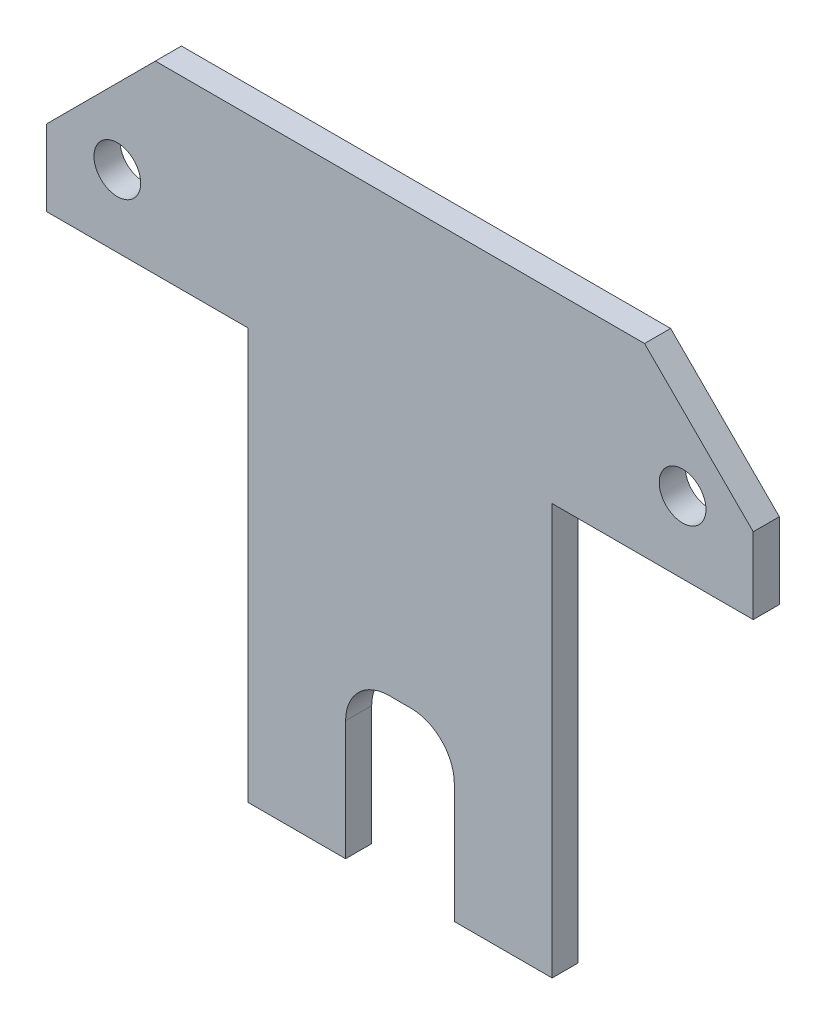
ISO-10303-21;
HEADER;
FILE_DESCRIPTION(('STEP AP214'),'2;1');
FILE_NAME('part.step','',(''),(''),'','','');
FILE_SCHEMA(('AUTOMOTIVE_DESIGN { 1 0 10303 214 1 1 1 1 }'));
ENDSEC;
DATA;
#1=APPLICATION_CONTEXT('core data for automotive mechanical design processes');
#2=APPLICATION_PROTOCOL_DEFINITION('international standard','automotive_design',2000,#1);
#3=PRODUCT_CONTEXT('',#1,'mechanical');
#4=PRODUCT('Part','Part','',(#3));
#5=PRODUCT_RELATED_PRODUCT_CATEGORY('part','',(#4));
#6=PRODUCT_DEFINITION_FORMATION('','',#4);
#7=PRODUCT_DEFINITION_CONTEXT('part definition',#1,'design');
#8=PRODUCT_DEFINITION('design','',#6,#7);
#9=PRODUCT_DEFINITION_SHAPE('','',#8);
#10=(LENGTH_UNIT() NAMED_UNIT(*) SI_UNIT(.MILLI.,.METRE.));
#11=(NAMED_UNIT(*) PLANE_ANGLE_UNIT() SI_UNIT($,.RADIAN.));
#12=(NAMED_UNIT(*) SI_UNIT($,.STERADIAN.) SOLID_ANGLE_UNIT());
#13=UNCERTAINTY_MEASURE_WITH_UNIT(LENGTH_MEASURE(1.E-05),#10,'distance_accuracy_value','');
#14=(GEOMETRIC_REPRESENTATION_CONTEXT(3) GLOBAL_UNCERTAINTY_ASSIGNED_CONTEXT((#13)) GLOBAL_UNIT_ASSIGNED_CONTEXT((#10,
#11,#12)) REPRESENTATION_CONTEXT('',''));
#15=CARTESIAN_POINT('',(0.,0.,0.));
#16=DIRECTION('',(0.,0.,1.));
#17=DIRECTION('',(1.,0.,0.));
#18=AXIS2_PLACEMENT_3D('',#15,#16,#17);
#19=CARTESIAN_POINT('',(15.3944155171797,-21.7253473807906,2.4));
#20=DIRECTION('',(0.,1.,0.));
#21=DIRECTION('',(0.,0.,1.));
#22=AXIS2_PLACEMENT_3D('',#19,#20,#21);
#23=PLANE('',#22);
#24=DIRECTION('',(1.,0.,0.));
#25=VECTOR('',#24,1.);
#26=CARTESIAN_POINT('',(15.3944155171797,-21.7253473807906,0.));
#27=LINE('',#26,#25);
#28=CARTESIAN_POINT('',(-12.6055844828203,-21.7253473807906,0.));
#29=VERTEX_POINT('',#28);
#30=CARTESIAN_POINT('',(-3.60558448282027,-21.7253473807906,0.));
#31=VERTEX_POINT('',#30);
#32=EDGE_CURVE('E165',#29,#31,#27,.T.);
#33=ORIENTED_EDGE('',*,*,#32,.T.);
#34=DIRECTION('',(0.,0.,1.));
#35=VECTOR('',#34,1.);
#36=CARTESIAN_POINT('',(-3.60558448282027,-21.7253473807906,2.4));
#37=LINE('',#36,#35);
#38=CARTESIAN_POINT('',(-3.60558448282027,-21.7253473807906,2.4));
#39=VERTEX_POINT('',#38);
#40=EDGE_CURVE('E153',#31,#39,#37,.T.);
#41=ORIENTED_EDGE('',*,*,#40,.T.);
#42=DIRECTION('',(1.,0.,0.));
#43=VECTOR('',#42,1.);
#44=CARTESIAN_POINT('',(15.3944155171797,-21.7253473807906,2.4));
#45=LINE('',#44,#43);
#46=CARTESIAN_POINT('',(-12.6055844828203,-21.7253473807906,2.4));
#47=VERTEX_POINT('',#46);
#48=EDGE_CURVE('E163',#47,#39,#45,.T.);
#49=ORIENTED_EDGE('',*,*,#48,.F.);
#50=DIRECTION('',(0.,0.,-1.));
#51=VECTOR('',#50,1.);
#52=CARTESIAN_POINT('',(-12.6055844828203,-21.7253473807906,2.4));
#53=LINE('',#52,#51);
#54=EDGE_CURVE('E230',#47,#29,#53,.T.);
#55=ORIENTED_EDGE('',*,*,#54,.T.);
#56=EDGE_LOOP('',(#33,#41,#49,#55));
#57=FACE_BOUND('',#56,.T.);
#58=ADVANCED_FACE('F38',(#57),#23,.F.);
#59=CARTESIAN_POINT('',(0.,0.,2.4));
#60=DIRECTION('',(0.,0.,-1.));
#61=DIRECTION('',(-1.,0.,0.));
#62=AXIS2_PLACEMENT_3D('',#59,#60,#61);
#63=PLANE('',#62);
#64=ORIENTED_EDGE('',*,*,#48,.T.);
#65=DIRECTION('',(0.,-1.,0.));
#66=VECTOR('',#65,1.);
#67=CARTESIAN_POINT('',(-3.60558448282027,-36.7253473807905,2.4));
#68=LINE('',#67,#66);
#69=CARTESIAN_POINT('',(-3.60558448282027,-10.7253473807906,2.4));
#70=VERTEX_POINT('',#69);
#71=EDGE_CURVE('E150',#70,#39,#68,.T.);
#72=ORIENTED_EDGE('',*,*,#71,.F.);
#73=CARTESIAN_POINT('',(0.394415517179731,-10.7253473807906,2.4));
#74=DIRECTION('',(0.,0.,-1.));
#75=DIRECTION('',(-1.,0.,0.));
#76=AXIS2_PLACEMENT_3D('',#73,#74,#75);
#77=CIRCLE('',#76,4.);
#78=CARTESIAN_POINT('',(0.394415517179728,-6.72534738079056,2.4));
#79=VERTEX_POINT('',#78);
#80=EDGE_CURVE('E46',#70,#79,#77,.T.);
#81=ORIENTED_EDGE('',*,*,#80,.T.);
#82=DIRECTION('',(-1.,0.,0.));
#83=VECTOR('',#82,1.);
#84=CARTESIAN_POINT('',(6.39441551717973,-6.72534738079055,2.4));
#85=LINE('',#84,#83);
#86=CARTESIAN_POINT('',(2.39441551717973,-6.72534738079056,2.4));
#87=VERTEX_POINT('',#86);
#88=EDGE_CURVE('E255',#87,#79,#85,.T.);
#89=ORIENTED_EDGE('',*,*,#88,.F.);
#90=CARTESIAN_POINT('',(2.39441551717973,-10.7253473807906,2.4));
#91=DIRECTION('',(0.,0.,-1.));
#92=DIRECTION('',(-1.,0.,0.));
#93=AXIS2_PLACEMENT_3D('',#90,#91,#92);
#94=CIRCLE('',#93,4.);
#95=CARTESIAN_POINT('',(6.39441551717973,-10.7253473807906,2.4));
#96=VERTEX_POINT('',#95);
#97=EDGE_CURVE('E250',#87,#96,#94,.T.);
#98=ORIENTED_EDGE('',*,*,#97,.T.);
#99=DIRECTION('',(0.,1.,0.));
#100=VECTOR('',#99,1.);
#101=CARTESIAN_POINT('',(6.39441551717973,-36.7253473807906,2.4));
#102=LINE('',#101,#100);
#103=CARTESIAN_POINT('',(6.39441551717973,-21.7253473807906,2.4));
#104=VERTEX_POINT('',#103);
#105=EDGE_CURVE('E158',#104,#96,#102,.T.);
#106=ORIENTED_EDGE('',*,*,#105,.F.);
#107=CARTESIAN_POINT('',(15.3944155171797,-21.7253473807906,2.4));
#108=VERTEX_POINT('',#107);
#109=EDGE_CURVE('E175',#104,#108,#45,.T.);
#110=ORIENTED_EDGE('',*,*,#109,.T.);
#111=DIRECTION('',(0.,1.,0.));
#112=VECTOR('',#111,1.);
#113=CARTESIAN_POINT('',(15.3944155171797,16.0746526192094,2.4));
#114=LINE('',#113,#112);
#115=CARTESIAN_POINT('',(15.3944155171797,16.0746526192094,2.4));
#116=VERTEX_POINT('',#115);
#117=EDGE_CURVE('E174',#108,#116,#114,.T.);
#118=ORIENTED_EDGE('',*,*,#117,.T.);
#119=DIRECTION('',(1.,0.,0.));
#120=VECTOR('',#119,1.);
#121=CARTESIAN_POINT('',(33.8944155171797,16.0746526192094,2.4));
#122=LINE('',#121,#120);
#123=CARTESIAN_POINT('',(33.8944155171797,16.0746526192094,2.4));
#124=VERTEX_POINT('',#123);
#125=EDGE_CURVE('E177',#116,#124,#122,.T.);
#126=ORIENTED_EDGE('',*,*,#125,.T.);
#127=DIRECTION('',(0.,1.,0.));
#128=VECTOR('',#127,1.);
#129=CARTESIAN_POINT('',(33.8944155171797,23.0746526192094,2.4));
#130=LINE('',#129,#128);
#131=CARTESIAN_POINT('',(33.8944155171797,23.0746526192094,2.4));
#132=VERTEX_POINT('',#131);
#133=EDGE_CURVE('E183',#124,#132,#130,.T.);
#134=ORIENTED_EDGE('',*,*,#133,.T.);
#135=DIRECTION('',(-0.707106781186548,0.707106781186547,0.));
#136=VECTOR('',#135,1.);
#137=CARTESIAN_POINT('',(23.8944155171797,33.0746526192094,2.4));
#138=LINE('',#137,#136);
#139=CARTESIAN_POINT('',(23.8944155171797,33.0746526192094,2.4));
#140=VERTEX_POINT('',#139);
#141=EDGE_CURVE('E185',#132,#140,#138,.T.);
#142=ORIENTED_EDGE('',*,*,#141,.T.);
#143=DIRECTION('',(-1.,0.,0.));
#144=VECTOR('',#143,1.);
#145=CARTESIAN_POINT('',(-21.1055844828203,33.0746526192094,2.4));
#146=LINE('',#145,#144);
#147=CARTESIAN_POINT('',(-21.1055844828203,33.0746526192094,2.4));
#148=VERTEX_POINT('',#147);
#149=EDGE_CURVE('E187',#140,#148,#146,.T.);
#150=ORIENTED_EDGE('',*,*,#149,.T.);
#151=DIRECTION('',(-0.707106781186548,-0.707106781186547,0.));
#152=VECTOR('',#151,1.);
#153=CARTESIAN_POINT('',(-31.1055844828203,23.0746526192094,2.4));
#154=LINE('',#153,#152);
#155=CARTESIAN_POINT('',(-31.1055844828203,23.0746526192094,2.4));
#156=VERTEX_POINT('',#155);
#157=EDGE_CURVE('E212',#148,#156,#154,.T.);
#158=ORIENTED_EDGE('',*,*,#157,.T.);
#159=DIRECTION('',(0.,-1.,0.));
#160=VECTOR('',#159,1.);
#161=CARTESIAN_POINT('',(-31.1055844828203,16.0746526192094,2.4));
#162=LINE('',#161,#160);
#163=CARTESIAN_POINT('',(-31.1055844828203,16.0746526192094,2.4));
#164=VERTEX_POINT('',#163);
#165=EDGE_CURVE('E316',#156,#164,#162,.T.);
#166=ORIENTED_EDGE('',*,*,#165,.T.);
#167=DIRECTION('',(1.,0.,0.));
#168=VECTOR('',#167,1.);
#169=CARTESIAN_POINT('',(-12.6055844828203,16.0746526192094,2.4));
#170=LINE('',#169,#168);
#171=CARTESIAN_POINT('',(-12.6055844828203,16.0746526192094,2.4));
#172=VERTEX_POINT('',#171);
#173=EDGE_CURVE('E317',#164,#172,#170,.T.);
#174=ORIENTED_EDGE('',*,*,#173,.T.);
#175=DIRECTION('',(0.,-1.,0.));
#176=VECTOR('',#175,1.);
#177=CARTESIAN_POINT('',(-12.6055844828203,-21.7253473807906,2.4));
#178=LINE('',#177,#176);
#179=EDGE_CURVE('E172',#172,#47,#178,.T.);
#180=ORIENTED_EDGE('',*,*,#179,.T.);
#181=EDGE_LOOP('',(#64,#72,#81,#89,#98,#106,#110,#118,#126,#134,#142,#150,#158,#166,#174,#180));
#182=FACE_BOUND('',#181,.T.);
#183=CARTESIAN_POINT('',(-24.6055844828203,22.6746526192094,2.4));
#184=DIRECTION('',(0.,0.,1.));
#185=DIRECTION('',(1.,0.,0.));
#186=AXIS2_PLACEMENT_3D('',#183,#184,#185);
#187=CIRCLE('',#186,2.15);
#188=CARTESIAN_POINT('',(-22.4555844828203,22.6746526192094,2.4));
#189=VERTEX_POINT('',#188);
#190=EDGE_CURVE('E194',#189,#189,#187,.T.);
#191=ORIENTED_EDGE('',*,*,#190,.F.);
#192=EDGE_LOOP('',(#191));
#193=FACE_BOUND('',#192,.T.);
#194=CARTESIAN_POINT('',(27.3944155171797,22.6746526192094,2.4));
#195=DIRECTION('',(0.,0.,1.));
#196=DIRECTION('',(1.,0.,0.));
#197=AXIS2_PLACEMENT_3D('',#194,#195,#196);
#198=CIRCLE('',#197,2.15);
#199=CARTESIAN_POINT('',(29.5444155171797,22.6746526192094,2.4));
#200=VERTEX_POINT('',#199);
#201=EDGE_CURVE('E302',#200,#200,#198,.T.);
#202=ORIENTED_EDGE('',*,*,#201,.F.);
#203=EDGE_LOOP('',(#202));
#204=FACE_BOUND('',#203,.T.);
#205=ADVANCED_FACE('F169',(#182,#193,#204),#63,.F.);
#206=CARTESIAN_POINT('',(0.,0.,0.));
#207=DIRECTION('',(0.,0.,-1.));
#208=DIRECTION('',(-1.,0.,0.));
#209=AXIS2_PLACEMENT_3D('',#206,#207,#208);
#210=PLANE('',#209);
#211=DIRECTION('',(-1.,0.,0.));
#212=VECTOR('',#211,1.);
#213=CARTESIAN_POINT('',(6.39441551717973,-6.72534738079055,0.));
#214=LINE('',#213,#212);
#215=CARTESIAN_POINT('',(2.39441551717973,-6.72534738079056,0.));
#216=VERTEX_POINT('',#215);
#217=CARTESIAN_POINT('',(0.394415517179728,-6.72534738079056,0.));
#218=VERTEX_POINT('',#217);
#219=EDGE_CURVE('E309',#216,#218,#214,.T.);
#220=ORIENTED_EDGE('',*,*,#219,.T.);
#221=CARTESIAN_POINT('',(0.394415517179731,-10.7253473807906,0.));
#222=DIRECTION('',(0.,0.,-1.));
#223=DIRECTION('',(-1.,0.,0.));
#224=AXIS2_PLACEMENT_3D('',#221,#222,#223);
#225=CIRCLE('',#224,4.);
#226=CARTESIAN_POINT('',(-3.60558448282027,-10.7253473807906,0.));
#227=VERTEX_POINT('',#226);
#228=EDGE_CURVE('E11',#218,#227,#225,.F.);
#229=ORIENTED_EDGE('',*,*,#228,.T.);
#230=DIRECTION('',(0.,-1.,0.));
#231=VECTOR('',#230,1.);
#232=CARTESIAN_POINT('',(-3.60558448282027,-36.7253473807905,0.));
#233=LINE('',#232,#231);
#234=EDGE_CURVE('E260',#227,#31,#233,.T.);
#235=ORIENTED_EDGE('',*,*,#234,.T.);
#236=ORIENTED_EDGE('',*,*,#32,.F.);
#237=DIRECTION('',(0.,-1.,0.));
#238=VECTOR('',#237,1.);
#239=CARTESIAN_POINT('',(-12.6055844828203,-21.7253473807906,0.));
#240=LINE('',#239,#238);
#241=CARTESIAN_POINT('',(-12.6055844828203,16.0746526192094,0.));
#242=VERTEX_POINT('',#241);
#243=EDGE_CURVE('E198',#242,#29,#240,.T.);
#244=ORIENTED_EDGE('',*,*,#243,.F.);
#245=DIRECTION('',(1.,0.,0.));
#246=VECTOR('',#245,1.);
#247=CARTESIAN_POINT('',(-12.6055844828203,16.0746526192094,0.));
#248=LINE('',#247,#246);
#249=CARTESIAN_POINT('',(-31.1055844828203,16.0746526192094,0.));
#250=VERTEX_POINT('',#249);
#251=EDGE_CURVE('E196',#250,#242,#248,.T.);
#252=ORIENTED_EDGE('',*,*,#251,.F.);
#253=DIRECTION('',(0.,-1.,0.));
#254=VECTOR('',#253,1.);
#255=CARTESIAN_POINT('',(-31.1055844828203,16.0746526192094,0.));
#256=LINE('',#255,#254);
#257=CARTESIAN_POINT('',(-31.1055844828203,23.0746526192094,0.));
#258=VERTEX_POINT('',#257);
#259=EDGE_CURVE('E193',#258,#250,#256,.T.);
#260=ORIENTED_EDGE('',*,*,#259,.F.);
#261=DIRECTION('',(-0.707106781186548,-0.707106781186547,0.));
#262=VECTOR('',#261,1.);
#263=CARTESIAN_POINT('',(-31.1055844828203,23.0746526192094,0.));
#264=LINE('',#263,#262);
#265=CARTESIAN_POINT('',(-21.1055844828203,33.0746526192094,0.));
#266=VERTEX_POINT('',#265);
#267=EDGE_CURVE('E190',#266,#258,#264,.T.);
#268=ORIENTED_EDGE('',*,*,#267,.F.);
#269=DIRECTION('',(-1.,0.,0.));
#270=VECTOR('',#269,1.);
#271=CARTESIAN_POINT('',(-21.1055844828203,33.0746526192094,0.));
#272=LINE('',#271,#270);
#273=CARTESIAN_POINT('',(23.8944155171797,33.0746526192094,0.));
#274=VERTEX_POINT('',#273);
#275=EDGE_CURVE('E210',#274,#266,#272,.T.);
#276=ORIENTED_EDGE('',*,*,#275,.F.);
#277=DIRECTION('',(-0.707106781186548,0.707106781186547,0.));
#278=VECTOR('',#277,1.);
#279=CARTESIAN_POINT('',(23.8944155171797,33.0746526192094,0.));
#280=LINE('',#279,#278);
#281=CARTESIAN_POINT('',(33.8944155171797,23.0746526192094,0.));
#282=VERTEX_POINT('',#281);
#283=EDGE_CURVE('E208',#282,#274,#280,.T.);
#284=ORIENTED_EDGE('',*,*,#283,.F.);
#285=DIRECTION('',(0.,1.,0.));
#286=VECTOR('',#285,1.);
#287=CARTESIAN_POINT('',(33.8944155171797,23.0746526192094,0.));
#288=LINE('',#287,#286);
#289=CARTESIAN_POINT('',(33.8944155171797,16.0746526192094,0.));
#290=VERTEX_POINT('',#289);
#291=EDGE_CURVE('E206',#290,#282,#288,.T.);
#292=ORIENTED_EDGE('',*,*,#291,.F.);
#293=DIRECTION('',(1.,0.,0.));
#294=VECTOR('',#293,1.);
#295=CARTESIAN_POINT('',(33.8944155171797,16.0746526192094,0.));
#296=LINE('',#295,#294);
#297=CARTESIAN_POINT('',(15.3944155171797,16.0746526192094,0.));
#298=VERTEX_POINT('',#297);
#299=EDGE_CURVE('E204',#298,#290,#296,.T.);
#300=ORIENTED_EDGE('',*,*,#299,.F.);
#301=DIRECTION('',(0.,1.,0.));
#302=VECTOR('',#301,1.);
#303=CARTESIAN_POINT('',(15.3944155171797,16.0746526192094,0.));
#304=LINE('',#303,#302);
#305=CARTESIAN_POINT('',(15.3944155171797,-21.7253473807906,0.));
#306=VERTEX_POINT('',#305);
#307=EDGE_CURVE('E202',#306,#298,#304,.T.);
#308=ORIENTED_EDGE('',*,*,#307,.F.);
#309=CARTESIAN_POINT('',(6.39441551717973,-21.7253473807906,0.));
#310=VERTEX_POINT('',#309);
#311=EDGE_CURVE('E200',#310,#306,#27,.T.);
#312=ORIENTED_EDGE('',*,*,#311,.F.);
#313=DIRECTION('',(0.,1.,0.));
#314=VECTOR('',#313,1.);
#315=CARTESIAN_POINT('',(6.39441551717973,-36.7253473807906,0.));
#316=LINE('',#315,#314);
#317=CARTESIAN_POINT('',(6.39441551717973,-10.7253473807906,0.));
#318=VERTEX_POINT('',#317);
#319=EDGE_CURVE('E325',#310,#318,#316,.T.);
#320=ORIENTED_EDGE('',*,*,#319,.T.);
#321=CARTESIAN_POINT('',(2.39441551717973,-10.7253473807906,0.));
#322=DIRECTION('',(0.,0.,-1.));
#323=DIRECTION('',(-1.,0.,0.));
#324=AXIS2_PLACEMENT_3D('',#321,#322,#323);
#325=CIRCLE('',#324,4.);
#326=EDGE_CURVE('E252',#318,#216,#325,.F.);
#327=ORIENTED_EDGE('',*,*,#326,.T.);
#328=EDGE_LOOP('',(#220,#229,#235,#236,#244,#252,#260,#268,#276,#284,#292,#300,#308,#312,#320,#327));
#329=FACE_BOUND('',#328,.T.);
#330=CARTESIAN_POINT('',(-24.6055844828203,22.6746526192094,0.));
#331=DIRECTION('',(0.,0.,1.));
#332=DIRECTION('',(1.,0.,0.));
#333=AXIS2_PLACEMENT_3D('',#330,#331,#332);
#334=CIRCLE('',#333,2.15);
#335=CARTESIAN_POINT('',(-22.4555844828203,22.6746526192094,0.));
#336=VERTEX_POINT('',#335);
#337=EDGE_CURVE('E305',#336,#336,#334,.T.);
#338=ORIENTED_EDGE('',*,*,#337,.T.);
#339=EDGE_LOOP('',(#338));
#340=FACE_BOUND('',#339,.T.);
#341=CARTESIAN_POINT('',(27.3944155171797,22.6746526192094,0.));
#342=DIRECTION('',(0.,0.,1.));
#343=DIRECTION('',(1.,0.,0.));
#344=AXIS2_PLACEMENT_3D('',#341,#342,#343);
#345=CIRCLE('',#344,2.15);
#346=CARTESIAN_POINT('',(29.5444155171797,22.6746526192094,0.));
#347=VERTEX_POINT('',#346);
#348=EDGE_CURVE('E306',#347,#347,#345,.T.);
#349=ORIENTED_EDGE('',*,*,#348,.T.);
#350=EDGE_LOOP('',(#349));
#351=FACE_BOUND('',#350,.T.);
#352=ADVANCED_FACE('F274',(#329,#340,#351),#210,.T.);
#353=CARTESIAN_POINT('',(-31.1055844828203,23.0746526192094,2.4));
#354=DIRECTION('',(0.707106781186547,-0.707106781186548,0.));
#355=DIRECTION('',(0.707106781186548,0.707106781186547,0.));
#356=AXIS2_PLACEMENT_3D('',#353,#354,#355);
#357=PLANE('',#356);
#358=ORIENTED_EDGE('',*,*,#267,.T.);
#359=DIRECTION('',(0.,0.,-1.));
#360=VECTOR('',#359,1.);
#361=CARTESIAN_POINT('',(-31.1055844828203,23.0746526192094,2.4));
#362=LINE('',#361,#360);
#363=EDGE_CURVE('E238',#156,#258,#362,.T.);
#364=ORIENTED_EDGE('',*,*,#363,.F.);
#365=ORIENTED_EDGE('',*,*,#157,.F.);
#366=DIRECTION('',(0.,0.,-1.));
#367=VECTOR('',#366,1.);
#368=CARTESIAN_POINT('',(-21.1055844828203,33.0746526192094,2.4));
#369=LINE('',#368,#367);
#370=EDGE_CURVE('E189',#148,#266,#369,.T.);
#371=ORIENTED_EDGE('',*,*,#370,.T.);
#372=EDGE_LOOP('',(#358,#364,#365,#371));
#373=FACE_BOUND('',#372,.T.);
#374=ADVANCED_FACE('F354',(#373),#357,.F.);
#375=CARTESIAN_POINT('',(-31.1055844828203,16.0746526192094,2.4));
#376=DIRECTION('',(1.,0.,0.));
#377=DIRECTION('',(0.,0.,-1.));
#378=AXIS2_PLACEMENT_3D('',#375,#376,#377);
#379=PLANE('',#378);
#380=ORIENTED_EDGE('',*,*,#259,.T.);
#381=DIRECTION('',(0.,0.,-1.));
#382=VECTOR('',#381,1.);
#383=CARTESIAN_POINT('',(-31.1055844828203,16.0746526192094,2.4));
#384=LINE('',#383,#382);
#385=EDGE_CURVE('E235',#164,#250,#384,.T.);
#386=ORIENTED_EDGE('',*,*,#385,.F.);
#387=ORIENTED_EDGE('',*,*,#165,.F.);
#388=ORIENTED_EDGE('',*,*,#363,.T.);
#389=EDGE_LOOP('',(#380,#386,#387,#388));
#390=FACE_BOUND('',#389,.T.);
#391=ADVANCED_FACE('F357',(#390),#379,.F.);
#392=CARTESIAN_POINT('',(-12.6055844828203,16.0746526192094,2.4));
#393=DIRECTION('',(0.,1.,0.));
#394=DIRECTION('',(0.,0.,1.));
#395=AXIS2_PLACEMENT_3D('',#392,#393,#394);
#396=PLANE('',#395);
#397=ORIENTED_EDGE('',*,*,#251,.T.);
#398=DIRECTION('',(0.,0.,-1.));
#399=VECTOR('',#398,1.);
#400=CARTESIAN_POINT('',(-12.6055844828203,16.0746526192094,2.4));
#401=LINE('',#400,#399);
#402=EDGE_CURVE('E232',#172,#242,#401,.T.);
#403=ORIENTED_EDGE('',*,*,#402,.F.);
#404=ORIENTED_EDGE('',*,*,#173,.F.);
#405=ORIENTED_EDGE('',*,*,#385,.T.);
#406=EDGE_LOOP('',(#397,#403,#404,#405));
#407=FACE_BOUND('',#406,.T.);
#408=ADVANCED_FACE('F288',(#407),#396,.F.);
#409=CARTESIAN_POINT('',(-12.6055844828203,-21.7253473807906,2.4));
#410=DIRECTION('',(1.,0.,0.));
#411=DIRECTION('',(0.,0.,-1.));
#412=AXIS2_PLACEMENT_3D('',#409,#410,#411);
#413=PLANE('',#412);
#414=ORIENTED_EDGE('',*,*,#243,.T.);
#415=ORIENTED_EDGE('',*,*,#54,.F.);
#416=ORIENTED_EDGE('',*,*,#179,.F.);
#417=ORIENTED_EDGE('',*,*,#402,.T.);
#418=EDGE_LOOP('',(#414,#415,#416,#417));
#419=FACE_BOUND('',#418,.T.);
#420=ADVANCED_FACE('F280',(#419),#413,.F.);
#421=ORIENTED_EDGE('',*,*,#109,.F.);
#422=DIRECTION('',(0.,0.,-1.));
#423=VECTOR('',#422,1.);
#424=CARTESIAN_POINT('',(6.39441551717973,-21.7253473807906,2.4));
#425=LINE('',#424,#423);
#426=EDGE_CURVE('E167',#104,#310,#425,.T.);
#427=ORIENTED_EDGE('',*,*,#426,.T.);
#428=ORIENTED_EDGE('',*,*,#311,.T.);
#429=DIRECTION('',(0.,0.,-1.));
#430=VECTOR('',#429,1.);
#431=CARTESIAN_POINT('',(15.3944155171797,-21.7253473807906,2.4));
#432=LINE('',#431,#430);
#433=EDGE_CURVE('E227',#108,#306,#432,.T.);
#434=ORIENTED_EDGE('',*,*,#433,.F.);
#435=EDGE_LOOP('',(#421,#427,#428,#434));
#436=FACE_BOUND('',#435,.T.);
#437=ADVANCED_FACE('F270',(#436),#23,.F.);
#438=CARTESIAN_POINT('',(15.3944155171797,16.0746526192094,2.4));
#439=DIRECTION('',(-1.,0.,0.));
#440=DIRECTION('',(0.,-1.,0.));
#441=AXIS2_PLACEMENT_3D('',#438,#439,#440);
#442=PLANE('',#441);
#443=ORIENTED_EDGE('',*,*,#307,.T.);
#444=DIRECTION('',(0.,0.,-1.));
#445=VECTOR('',#444,1.);
#446=CARTESIAN_POINT('',(15.3944155171797,16.0746526192094,2.4));
#447=LINE('',#446,#445);
#448=EDGE_CURVE('E224',#116,#298,#447,.T.);
#449=ORIENTED_EDGE('',*,*,#448,.F.);
#450=ORIENTED_EDGE('',*,*,#117,.F.);
#451=ORIENTED_EDGE('',*,*,#433,.T.);
#452=EDGE_LOOP('',(#443,#449,#450,#451));
#453=FACE_BOUND('',#452,.T.);
#454=ADVANCED_FACE('F279',(#453),#442,.F.);
#455=CARTESIAN_POINT('',(33.8944155171797,16.0746526192094,2.4));
#456=DIRECTION('',(0.,1.,0.));
#457=DIRECTION('',(0.,0.,1.));
#458=AXIS2_PLACEMENT_3D('',#455,#456,#457);
#459=PLANE('',#458);
#460=ORIENTED_EDGE('',*,*,#299,.T.);
#461=DIRECTION('',(0.,0.,-1.));
#462=VECTOR('',#461,1.);
#463=CARTESIAN_POINT('',(33.8944155171797,16.0746526192094,2.4));
#464=LINE('',#463,#462);
#465=EDGE_CURVE('E221',#124,#290,#464,.T.);
#466=ORIENTED_EDGE('',*,*,#465,.F.);
#467=ORIENTED_EDGE('',*,*,#125,.F.);
#468=ORIENTED_EDGE('',*,*,#448,.T.);
#469=EDGE_LOOP('',(#460,#466,#467,#468));
#470=FACE_BOUND('',#469,.T.);
#471=ADVANCED_FACE('F286',(#470),#459,.F.);
#472=CARTESIAN_POINT('',(33.8944155171797,23.0746526192094,2.4));
#473=DIRECTION('',(-1.,0.,0.));
#474=DIRECTION('',(0.,0.,1.));
#475=AXIS2_PLACEMENT_3D('',#472,#473,#474);
#476=PLANE('',#475);
#477=ORIENTED_EDGE('',*,*,#291,.T.);
#478=DIRECTION('',(0.,0.,-1.));
#479=VECTOR('',#478,1.);
#480=CARTESIAN_POINT('',(33.8944155171797,23.0746526192094,2.4));
#481=LINE('',#480,#479);
#482=EDGE_CURVE('E218',#132,#282,#481,.T.);
#483=ORIENTED_EDGE('',*,*,#482,.F.);
#484=ORIENTED_EDGE('',*,*,#133,.F.);
#485=ORIENTED_EDGE('',*,*,#465,.T.);
#486=EDGE_LOOP('',(#477,#483,#484,#485));
#487=FACE_BOUND('',#486,.T.);
#488=ADVANCED_FACE('F341',(#487),#476,.F.);
#489=CARTESIAN_POINT('',(23.8944155171797,33.0746526192094,2.4));
#490=DIRECTION('',(-0.707106781186547,-0.707106781186548,0.));
#491=DIRECTION('',(0.707106781186548,-0.707106781186547,0.));
#492=AXIS2_PLACEMENT_3D('',#489,#490,#491);
#493=PLANE('',#492);
#494=ORIENTED_EDGE('',*,*,#283,.T.);
#495=DIRECTION('',(0.,0.,-1.));
#496=VECTOR('',#495,1.);
#497=CARTESIAN_POINT('',(23.8944155171797,33.0746526192094,2.4));
#498=LINE('',#497,#496);
#499=EDGE_CURVE('E215',#140,#274,#498,.T.);
#500=ORIENTED_EDGE('',*,*,#499,.F.);
#501=ORIENTED_EDGE('',*,*,#141,.F.);
#502=ORIENTED_EDGE('',*,*,#482,.T.);
#503=EDGE_LOOP('',(#494,#500,#501,#502));
#504=FACE_BOUND('',#503,.T.);
#505=ADVANCED_FACE('F345',(#504),#493,.F.);
#506=CARTESIAN_POINT('',(-21.1055844828203,33.0746526192094,2.4));
#507=DIRECTION('',(0.,-1.,0.));
#508=DIRECTION('',(0.,0.,-1.));
#509=AXIS2_PLACEMENT_3D('',#506,#507,#508);
#510=PLANE('',#509);
#511=ORIENTED_EDGE('',*,*,#275,.T.);
#512=ORIENTED_EDGE('',*,*,#370,.F.);
#513=ORIENTED_EDGE('',*,*,#149,.F.);
#514=ORIENTED_EDGE('',*,*,#499,.T.);
#515=EDGE_LOOP('',(#511,#512,#513,#514));
#516=FACE_BOUND('',#515,.T.);
#517=ADVANCED_FACE('F350',(#516),#510,.F.);
#518=CARTESIAN_POINT('',(-24.6055844828203,22.6746526192094,2.4));
#519=DIRECTION('',(0.,0.,-1.));
#520=DIRECTION('',(-1.,0.,0.));
#521=AXIS2_PLACEMENT_3D('',#518,#519,#520);
#522=CYLINDRICAL_SURFACE('',#521,2.15);
#523=ORIENTED_EDGE('',*,*,#190,.T.);
#524=EDGE_LOOP('',(#523));
#525=FACE_BOUND('',#524,.T.);
#526=ORIENTED_EDGE('',*,*,#337,.F.);
#527=EDGE_LOOP('',(#526));
#528=FACE_BOUND('',#527,.T.);
#529=ADVANCED_FACE('F376',(#525,#528),#522,.F.);
#530=CARTESIAN_POINT('',(27.3944155171797,22.6746526192094,2.4));
#531=DIRECTION('',(0.,0.,-1.));
#532=DIRECTION('',(-1.,0.,0.));
#533=AXIS2_PLACEMENT_3D('',#530,#531,#532);
#534=CYLINDRICAL_SURFACE('',#533,2.15);
#535=ORIENTED_EDGE('',*,*,#201,.T.);
#536=EDGE_LOOP('',(#535));
#537=FACE_BOUND('',#536,.T.);
#538=ORIENTED_EDGE('',*,*,#348,.F.);
#539=EDGE_LOOP('',(#538));
#540=FACE_BOUND('',#539,.T.);
#541=ADVANCED_FACE('F404',(#537,#540),#534,.F.);
#542=CARTESIAN_POINT('',(-3.60558448282027,-36.7253473807905,0.));
#543=DIRECTION('',(-1.,0.,0.));
#544=DIRECTION('',(0.,-1.,0.));
#545=AXIS2_PLACEMENT_3D('',#542,#543,#544);
#546=PLANE('',#545);
#547=ORIENTED_EDGE('',*,*,#234,.F.);
#548=DIRECTION('',(0.,0.,1.));
#549=VECTOR('',#548,1.);
#550=CARTESIAN_POINT('',(-3.60558448282027,-10.7253473807906,2.4));
#551=LINE('',#550,#549);
#552=EDGE_CURVE('E155',#227,#70,#551,.T.);
#553=ORIENTED_EDGE('',*,*,#552,.T.);
#554=ORIENTED_EDGE('',*,*,#71,.T.);
#555=ORIENTED_EDGE('',*,*,#40,.F.);
#556=EDGE_LOOP('',(#547,#553,#554,#555));
#557=FACE_BOUND('',#556,.T.);
#558=ADVANCED_FACE('F152',(#557),#546,.F.);
#559=CARTESIAN_POINT('',(6.39441551717973,-36.7253473807906,0.));
#560=DIRECTION('',(1.,0.,0.));
#561=DIRECTION('',(0.,1.,0.));
#562=AXIS2_PLACEMENT_3D('',#559,#560,#561);
#563=PLANE('',#562);
#564=ORIENTED_EDGE('',*,*,#105,.T.);
#565=DIRECTION('',(0.,0.,1.));
#566=VECTOR('',#565,1.);
#567=CARTESIAN_POINT('',(6.39441551717973,-10.7253473807906,0.));
#568=LINE('',#567,#566);
#569=EDGE_CURVE('E247',#96,#318,#568,.F.);
#570=ORIENTED_EDGE('',*,*,#569,.T.);
#571=ORIENTED_EDGE('',*,*,#319,.F.);
#572=ORIENTED_EDGE('',*,*,#426,.F.);
#573=EDGE_LOOP('',(#564,#570,#571,#572));
#574=FACE_BOUND('',#573,.T.);
#575=ADVANCED_FACE('F330',(#574),#563,.F.);
#576=CARTESIAN_POINT('',(6.39441551717973,-6.72534738079055,0.));
#577=DIRECTION('',(0.,1.,0.));
#578=DIRECTION('',(-1.,0.,0.));
#579=AXIS2_PLACEMENT_3D('',#576,#577,#578);
#580=PLANE('',#579);
#581=ORIENTED_EDGE('',*,*,#219,.F.);
#582=DIRECTION('',(0.,0.,1.));
#583=VECTOR('',#582,1.);
#584=CARTESIAN_POINT('',(2.39441551717973,-6.72534738079056,2.4));
#585=LINE('',#584,#583);
#586=EDGE_CURVE('E244',#216,#87,#585,.T.);
#587=ORIENTED_EDGE('',*,*,#586,.T.);
#588=ORIENTED_EDGE('',*,*,#88,.T.);
#589=DIRECTION('',(0.,0.,1.));
#590=VECTOR('',#589,1.);
#591=CARTESIAN_POINT('',(0.394415517179728,-6.72534738079056,0.));
#592=LINE('',#591,#590);
#593=EDGE_CURVE('E166',#79,#218,#592,.F.);
#594=ORIENTED_EDGE('',*,*,#593,.T.);
#595=EDGE_LOOP('',(#581,#587,#588,#594));
#596=FACE_BOUND('',#595,.T.);
#597=ADVANCED_FACE('F258',(#596),#580,.F.);
#598=CARTESIAN_POINT('',(2.39441551717973,-10.7253473807906,0.));
#599=DIRECTION('',(0.,0.,-1.));
#600=DIRECTION('',(-1.,0.,0.));
#601=AXIS2_PLACEMENT_3D('',#598,#599,#600);
#602=CYLINDRICAL_SURFACE('',#601,4.);
#603=ORIENTED_EDGE('',*,*,#326,.F.);
#604=ORIENTED_EDGE('',*,*,#569,.F.);
#605=ORIENTED_EDGE('',*,*,#97,.F.);
#606=ORIENTED_EDGE('',*,*,#586,.F.);
#607=EDGE_LOOP('',(#603,#604,#605,#606));
#608=FACE_BOUND('',#607,.T.);
#609=ADVANCED_FACE('F263',(#608),#602,.F.);
#610=CARTESIAN_POINT('',(0.394415517179731,-10.7253473807906,0.));
#611=DIRECTION('',(0.,0.,-1.));
#612=DIRECTION('',(-1.,0.,0.));
#613=AXIS2_PLACEMENT_3D('',#610,#611,#612);
#614=CYLINDRICAL_SURFACE('',#613,4.);
#615=ORIENTED_EDGE('',*,*,#228,.F.);
#616=ORIENTED_EDGE('',*,*,#593,.F.);
#617=ORIENTED_EDGE('',*,*,#80,.F.);
#618=ORIENTED_EDGE('',*,*,#552,.F.);
#619=EDGE_LOOP('',(#615,#616,#617,#618));
#620=FACE_BOUND('',#619,.T.);
#621=ADVANCED_FACE('F40',(#620),#614,.F.);
#622=CLOSED_SHELL('',(#58,#205,#352,#374,#391,#408,#420,#437,#454,#471,#488,#505,#517,#529,#541,
#558,#575,#597,#609,#621));
#623=MANIFOLD_SOLID_BREP('B2',#622);
#624=ADVANCED_BREP_SHAPE_REPRESENTATION('',(#18,#623),#14);
#625=SHAPE_DEFINITION_REPRESENTATION(#9,#624);
ENDSEC;
END-ISO-10303-21;
